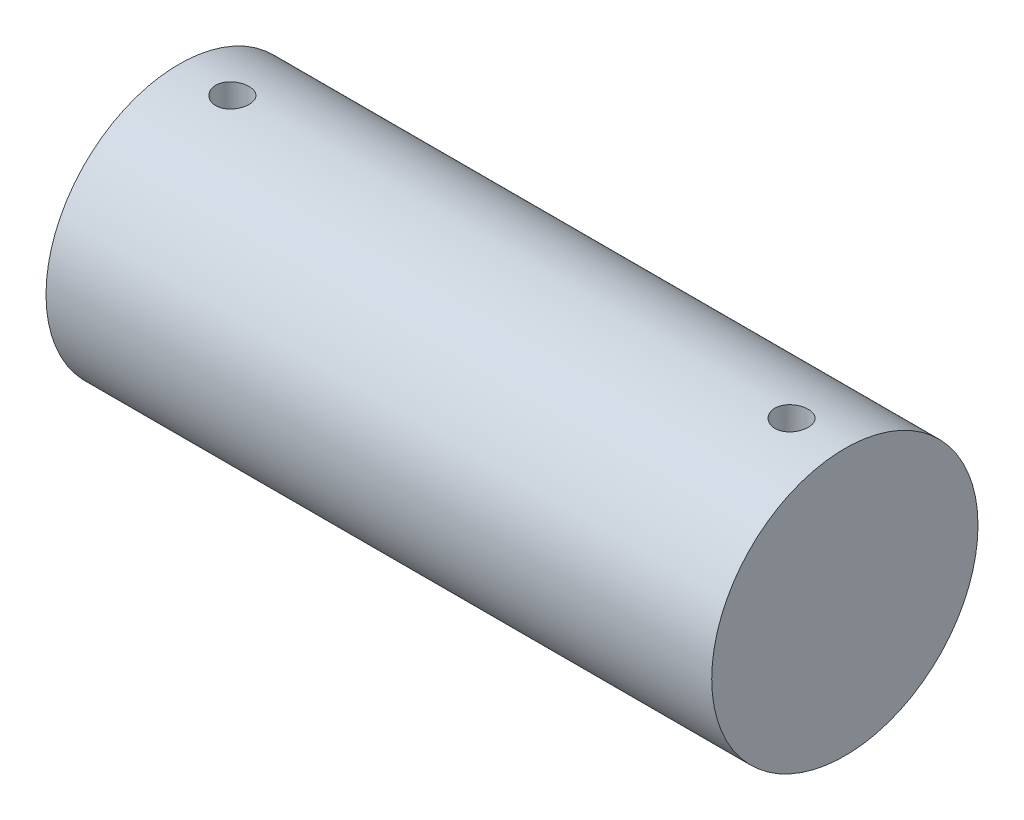
ISO-10303-21;
HEADER;
FILE_DESCRIPTION(('STEP AP214'),'2;1');
FILE_NAME('part.step','',(''),(''),'','','');
FILE_SCHEMA(('AUTOMOTIVE_DESIGN { 1 0 10303 214 1 1 1 1 }'));
ENDSEC;
DATA;
#1=APPLICATION_CONTEXT('core data for automotive mechanical design processes');
#2=APPLICATION_PROTOCOL_DEFINITION('international standard','automotive_design',2000,#1);
#3=PRODUCT_CONTEXT('',#1,'mechanical');
#4=PRODUCT('Part','Part','',(#3));
#5=PRODUCT_RELATED_PRODUCT_CATEGORY('part','',(#4));
#6=PRODUCT_DEFINITION_FORMATION('','',#4);
#7=PRODUCT_DEFINITION_CONTEXT('part definition',#1,'design');
#8=PRODUCT_DEFINITION('design','',#6,#7);
#9=PRODUCT_DEFINITION_SHAPE('','',#8);
#10=(LENGTH_UNIT() NAMED_UNIT(*) SI_UNIT(.MILLI.,.METRE.));
#11=(NAMED_UNIT(*) PLANE_ANGLE_UNIT() SI_UNIT($,.RADIAN.));
#12=(NAMED_UNIT(*) SI_UNIT($,.STERADIAN.) SOLID_ANGLE_UNIT());
#13=UNCERTAINTY_MEASURE_WITH_UNIT(LENGTH_MEASURE(1.E-05),#10,'distance_accuracy_value','');
#14=(GEOMETRIC_REPRESENTATION_CONTEXT(3) GLOBAL_UNCERTAINTY_ASSIGNED_CONTEXT((#13)) GLOBAL_UNIT_ASSIGNED_CONTEXT((#10,
#11,#12)) REPRESENTATION_CONTEXT('',''));
#15=CARTESIAN_POINT('',(0.,0.,0.));
#16=DIRECTION('',(0.,0.,1.));
#17=DIRECTION('',(1.,0.,0.));
#18=AXIS2_PLACEMENT_3D('',#15,#16,#17);
#19=CARTESIAN_POINT('',(7.49999975746537,1.51517477467844E-08,6.06634770287263E-08));
#20=DIRECTION('',(-1.,0.,0.));
#21=DIRECTION('',(0.,0.,1.));
#22=AXIS2_PLACEMENT_3D('',#19,#20,#21);
#23=CYLINDRICAL_SURFACE('',#22,1.);
#24=CARTESIAN_POINT('',(7.49999975746537,1.51517477467844E-08,6.06634770287263E-08));
#25=DIRECTION('',(1.,0.,0.));
#26=DIRECTION('',(0.,0.,-1.));
#27=AXIS2_PLACEMENT_3D('',#24,#25,#26);
#28=CIRCLE('',#27,1.);
#29=CARTESIAN_POINT('',(7.49999975746537,1.51517477467844E-08,-0.999999939336523));
#30=VERTEX_POINT('',#29);
#31=EDGE_CURVE('E10',#30,#30,#28,.T.);
#32=ORIENTED_EDGE('',*,*,#31,.F.);
#33=EDGE_LOOP('',(#32));
#34=FACE_BOUND('',#33,.T.);
#35=CARTESIAN_POINT('',(2.49999975746537,1.51517477467844E-08,6.06634770287263E-08));
#36=DIRECTION('',(1.,0.,0.));
#37=DIRECTION('',(0.,0.,-1.));
#38=AXIS2_PLACEMENT_3D('',#35,#36,#37);
#39=CIRCLE('',#38,1.);
#40=CARTESIAN_POINT('',(2.49999975746537,1.51517477467844E-08,-0.999999939336523));
#41=VERTEX_POINT('',#40);
#42=EDGE_CURVE('E49',#41,#41,#39,.T.);
#43=ORIENTED_EDGE('',*,*,#42,.T.);
#44=EDGE_LOOP('',(#43));
#45=FACE_BOUND('',#44,.T.);
#46=CARTESIAN_POINT('',(7.09999975746537,-0.992156726497474,-0.124999939336523));
#47=CARTESIAN_POINT('',(7.10699157165496,-0.992156826933916,-0.12499964207822));
#48=CARTESIAN_POINT('',(7.11398775571061,-0.992231432407725,-0.124411334287587));
#49=CARTESIAN_POINT('',(7.1277854187356,-0.992521680338238,-0.12207376002259));
#50=CARTESIAN_POINT('',(7.13458668649022,-0.992737470169733,-0.120323280391087));
#51=CARTESIAN_POINT('',(7.14779275157117,-0.993285271735966,-0.115713773977821));
#52=CARTESIAN_POINT('',(7.1541978145713,-0.993617204575078,-0.112855499576434));
#53=CARTESIAN_POINT('',(7.16643618005653,-0.994359796608206,-0.106113149257999));
#54=CARTESIAN_POINT('',(7.17226958005252,-0.994770442340394,-0.102229248705262));
#55=CARTESIAN_POINT('',(7.18323286982148,-0.995626764470202,-0.0935226118497431));
#56=CARTESIAN_POINT('',(7.18835909758132,-0.996072605699274,-0.0886952800877367));
#57=CARTESIAN_POINT('',(7.19773089591233,-0.996947601286168,-0.0782487023700833));
#58=CARTESIAN_POINT('',(7.20197642267011,-0.997376754812944,-0.072629417039424));
#59=CARTESIAN_POINT('',(7.20947943644069,-0.998171707154664,-0.0607354308703211));
#60=CARTESIAN_POINT('',(7.21273360972035,-0.998537291771655,-0.054458624114578));
#61=CARTESIAN_POINT('',(7.21814031746242,-0.999162103325515,-0.0414422752393181));
#62=CARTESIAN_POINT('',(7.2202928928117,-0.999421334209736,-0.0347027503045677));
#63=CARTESIAN_POINT('',(7.22342436088209,-0.999803069201366,-0.0209897237240781));
#64=CARTESIAN_POINT('',(7.22440934139156,-0.999926282266222,-0.0140176323196913));
#65=CARTESIAN_POINT('',(7.2251965267172,-1.00002451971286,-6.09937084979584E-06));
#66=CARTESIAN_POINT('',(7.224998778063,-0.999999549924291,0.00703333951321602));
#67=CARTESIAN_POINT('',(7.2234309973275,-0.999804808733257,0.0209383241122047));
#68=CARTESIAN_POINT('',(7.2220675125413,-0.999635846076116,0.0278046209516998));
#69=CARTESIAN_POINT('',(7.21821719863387,-0.999173012819419,0.0412101688587459));
#70=CARTESIAN_POINT('',(7.21573034815703,-0.998879139845275,0.0477494137062874));
#71=CARTESIAN_POINT('',(7.20969693282618,-0.998198113752209,0.0603355014354091));
#72=CARTESIAN_POINT('',(7.20614753457886,-0.997810711769871,0.0663809720555031));
#73=CARTESIAN_POINT('',(7.19809183935457,-0.996985969380893,0.077792933278801));
#74=CARTESIAN_POINT('',(7.19358549849194,-0.996548626684384,0.083159392724345));
#75=CARTESIAN_POINT('',(7.18370716653545,-0.995669418610009,0.0930994622021242));
#76=CARTESIAN_POINT('',(7.17832946948804,-0.995227542750616,0.0976674026632766));
#77=CARTESIAN_POINT('',(7.16688067962625,-0.994392020818542,0.105836703194732));
#78=CARTESIAN_POINT('',(7.16080958463847,-0.993998374897042,0.109438060235232));
#79=CARTESIAN_POINT('',(7.14814128268725,-0.993303886154611,0.115572289342614));
#80=CARTESIAN_POINT('',(7.14154385346771,-0.993003082802318,0.118104707156593));
#81=CARTESIAN_POINT('',(7.12801278478903,-0.99252910609623,0.122024143386881));
#82=CARTESIAN_POINT('',(7.12107916154993,-0.992355926591604,0.123411217003458));
#83=CARTESIAN_POINT('',(7.10712259836538,-0.992157929240277,0.124993082258907));
#84=CARTESIAN_POINT('',(7.10010057631093,-0.99213211856944,0.125195852763391));
#85=CARTESIAN_POINT('',(7.0861226609821,-0.992229155408076,0.124424408325005));
#86=CARTESIAN_POINT('',(7.07916676630141,-0.992351999748978,0.123450218468967));
#87=CARTESIAN_POINT('',(7.06554246928648,-0.992731599090245,0.120359224953363));
#88=CARTESIAN_POINT('',(7.05887317670585,-0.992987901195582,0.11824628485078));
#89=CARTESIAN_POINT('',(7.04598354972271,-0.993605169833656,0.112941746619283));
#90=CARTESIAN_POINT('',(7.03976323110333,-0.993966140043634,0.109750110592538));
#91=CARTESIAN_POINT('',(7.02791202527472,-0.994754450524869,0.102359161771223));
#92=CARTESIAN_POINT('',(7.02228442419965,-0.995182131216793,0.0981546166423325));
#93=CARTESIAN_POINT('',(7.01181192976862,-0.996054604623763,0.0888645977819252));
#94=CARTESIAN_POINT('',(7.00696706687197,-0.996499398003896,0.0837790897847514));
#95=CARTESIAN_POINT('',(6.99816954809865,-0.997359029191732,0.0728366494414032));
#96=CARTESIAN_POINT('',(6.99422213512562,-0.997773681804513,0.0669754852693287));
#97=CARTESIAN_POINT('',(6.98736784658368,-0.998523541364057,0.0546686897475665));
#98=CARTESIAN_POINT('',(6.98446095004132,-0.998858749912109,0.0482230701818932));
#99=CARTESIAN_POINT('',(6.97977886811997,-0.999411130174846,0.0349477536204497));
#100=CARTESIAN_POINT('',(6.97800065266379,-0.999628617692105,0.0281191389890659));
#101=CARTESIAN_POINT('',(6.97561655300403,-0.999922362187034,0.0142573635273749));
#102=CARTESIAN_POINT('',(6.97501061593541,-0.999998625533341,0.00722421193538219));
#103=CARTESIAN_POINT('',(6.97498926135076,-1.00000129885508,-0.00679579850371256));
#104=CARTESIAN_POINT('',(6.97556575943697,-0.999928726432172,-0.0137826462222602));
#105=CARTESIAN_POINT('',(6.97787578813691,-0.999643905427222,-0.0275593264091541));
#106=CARTESIAN_POINT('',(6.97960931794596,-0.999431656942325,-0.0343491590145156));
#107=CARTESIAN_POINT('',(6.98418166318286,-0.998891227454269,-0.0475380114858888));
#108=CARTESIAN_POINT('',(6.98702009143403,-0.998563087065487,-0.0539371673445017));
#109=CARTESIAN_POINT('',(6.99372082319575,-0.997827208651393,-0.0661696061937243));
#110=CARTESIAN_POINT('',(6.99758313887846,-0.997419469679812,-0.0720028824559245));
#111=CARTESIAN_POINT('',(7.00625191823219,-0.996566581811041,-0.0829792777346509));
#112=CARTESIAN_POINT('',(7.01106439714155,-0.996121205487712,-0.0881176287282381));
#113=CARTESIAN_POINT('',(7.02148440466681,-0.995245064355023,-0.0975169952774904));
#114=CARTESIAN_POINT('',(7.02709212133992,-0.994814303031751,-0.101777802726197));
#115=CARTESIAN_POINT('',(7.03896825360024,-0.994014390545596,-0.109315201462325));
#116=CARTESIAN_POINT('',(7.04523913696213,-0.993645483724393,-0.11258792849486));
#117=CARTESIAN_POINT('',(7.05824259449511,-0.993013913908063,-0.118029203753691));
#118=CARTESIAN_POINT('',(7.06497465743054,-0.992751135425191,-0.120198952897938));
#119=CARTESIAN_POINT('',(7.07645125681755,-0.992425378258173,-0.122853234148422));
#120=CARTESIAN_POINT('',(7.08112340504225,-0.992325135609207,-0.123657090887052));
#121=CARTESIAN_POINT('',(7.09052961996372,-0.992190775963208,-0.124730542131798));
#122=CARTESIAN_POINT('',(7.09526368619042,-0.992156658464466,-0.125000140691489));
#123=CARTESIAN_POINT('',(7.09999975746537,-0.992156726497474,-0.124999939336523));
#124=B_SPLINE_CURVE_WITH_KNOTS('',3,(#46,#47,#48,#49,#50,#51,#52,#53,#54,#55,#56,#57,#58,#59,
#60,#61,#62,#63,#64,#65,#66,#67,#68,#69,#70,#71,#72,#73,#74,#75,#76,#77,#78,#79,#80,#81,#82,#83,
#84,#85,#86,#87,#88,#89,#90,#91,#92,#93,#94,#95,#96,#97,#98,#99,#100,#101,#102,#103,#104,#105,
#106,#107,#108,#109,#110,#111,#112,#113,#114,#115,#116,#117,#118,#119,#120,#121,#122,#123),
.UNSPECIFIED.,.T.,.F.,(4,2,2,2,2,2,2,2,2,2,2,2,2,2,2,2,2,2,2,2,2,2,2,2,2,2,2,2,2,2,2,2,2,2,2,2,
2,2,4),(0.,0.0209581408739618,0.0419381938076193,0.0629040226290611,0.0838662689753075,
0.104933288774534,0.12600135637129,0.147139093072871,0.168276045169916,0.189302298470729,
0.210327724585054,0.231235832466519,0.252144337835895,0.273109102206402,0.294074828234553,
0.315183848688885,0.336292935309712,0.357410983369504,0.378528013578094,0.39950260890294,
0.420476757163557,0.441380188146366,0.462284353605925,0.483298909772054,0.504314283497405,
0.525449442946171,0.546584176354438,0.56766192839247,0.588738729886406,0.609671908144127,
0.630605071843394,0.651530906772044,0.672456990482123,0.693520064445417,0.714588127719914,
0.735737548852416,0.756863892991007,0.771060494816473,0.785256988927736),.UNSPECIFIED.);
#125=CARTESIAN_POINT('',(7.09999975746537,-0.992156726497474,-0.124999939336523));
#126=VERTEX_POINT('',#125);
#127=EDGE_CURVE('E57',#126,#126,#124,.T.);
#128=ORIENTED_EDGE('',*,*,#127,.F.);
#129=EDGE_LOOP('',(#128));
#130=FACE_BOUND('',#129,.T.);
#131=CARTESIAN_POINT('',(7.09999975746537,0.992156756800969,-0.124999939336523));
#132=CARTESIAN_POINT('',(7.09300794327578,0.992156857237412,-0.12499964207822));
#133=CARTESIAN_POINT('',(7.08601175922013,0.99223146271122,-0.124411334287587));
#134=CARTESIAN_POINT('',(7.07221409619514,0.992521710641733,-0.12207376002259));
#135=CARTESIAN_POINT('',(7.06541282844052,0.992737500473228,-0.120323280391087));
#136=CARTESIAN_POINT('',(7.05220676335957,0.993285302039461,-0.115713773977821));
#137=CARTESIAN_POINT('',(7.04580170035944,0.993617234878573,-0.112855499576435));
#138=CARTESIAN_POINT('',(7.03356333487422,0.994359826911701,-0.106113149257999));
#139=CARTESIAN_POINT('',(7.02772993487822,0.994770472643889,-0.102229248705262));
#140=CARTESIAN_POINT('',(7.01676664510927,0.995626794773698,-0.0935226118497431));
#141=CARTESIAN_POINT('',(7.01164041734943,0.996072636002769,-0.0886952800877375));
#142=CARTESIAN_POINT('',(7.00226861901842,0.996947631589664,-0.0782487023700841));
#143=CARTESIAN_POINT('',(6.99802309226064,0.997376785116439,-0.072629417039424));
#144=CARTESIAN_POINT('',(6.99052007849005,0.998171737458159,-0.0607354308703208));
#145=CARTESIAN_POINT('',(6.98726590521039,0.99853732207515,-0.0544586241145781));
#146=CARTESIAN_POINT('',(6.98185919746832,0.999162133629011,-0.0414422752393183));
#147=CARTESIAN_POINT('',(6.97970662211904,0.999421364513231,-0.0347027503045677));
#148=CARTESIAN_POINT('',(6.97657515404865,0.999803099504862,-0.0209897237240781));
#149=CARTESIAN_POINT('',(6.97559017353918,0.999926312569718,-0.0140176323196914));
#150=CARTESIAN_POINT('',(6.97480298821354,1.00002455001636,-6.09937084995E-06));
#151=CARTESIAN_POINT('',(6.97500073686775,0.999999580227786,0.00703333951321588));
#152=CARTESIAN_POINT('',(6.97656851760324,0.999804839036752,0.0209383241122046));
#153=CARTESIAN_POINT('',(6.97793200238944,0.999635876379611,0.0278046209516999));
#154=CARTESIAN_POINT('',(6.98178231629687,0.999173043122914,0.041210168858746));
#155=CARTESIAN_POINT('',(6.98426916677371,0.998879170148771,0.0477494137062874));
#156=CARTESIAN_POINT('',(6.99030258210456,0.998198144055704,0.0603355014354091));
#157=CARTESIAN_POINT('',(6.99385198035188,0.997810742073367,0.0663809720555032));
#158=CARTESIAN_POINT('',(7.00190767557617,0.996985999684389,0.077792933278801));
#159=CARTESIAN_POINT('',(7.0064140164388,0.996548656987879,0.083159392724345));
#160=CARTESIAN_POINT('',(7.01629234839529,0.995669448913504,0.0930994622021245));
#161=CARTESIAN_POINT('',(7.02167004544271,0.995227573054111,0.0976674026632771));
#162=CARTESIAN_POINT('',(7.03311883530449,0.994392051122037,0.105836703194732));
#163=CARTESIAN_POINT('',(7.03918993029227,0.993998405200538,0.109438060235232));
#164=CARTESIAN_POINT('',(7.05185823224349,0.993303916458107,0.115572289342613));
#165=CARTESIAN_POINT('',(7.05845566146303,0.993003113105813,0.118104707156593));
#166=CARTESIAN_POINT('',(7.07198673014171,0.992529136399726,0.122024143386881));
#167=CARTESIAN_POINT('',(7.07892035338081,0.992355956895099,0.123411217003458));
#168=CARTESIAN_POINT('',(7.09287691656536,0.992157959543773,0.124993082258907));
#169=CARTESIAN_POINT('',(7.09989893861981,0.992132148872935,0.125195852763391));
#170=CARTESIAN_POINT('',(7.11387685394864,0.992229185711571,0.124424408325005));
#171=CARTESIAN_POINT('',(7.12083274862934,0.992352030052473,0.123450218468967));
#172=CARTESIAN_POINT('',(7.13445704564426,0.992731629393741,0.120359224953363));
#173=CARTESIAN_POINT('',(7.14112633822489,0.992987931499078,0.11824628485078));
#174=CARTESIAN_POINT('',(7.15401596520803,0.993605200137151,0.112941746619283));
#175=CARTESIAN_POINT('',(7.16023628382742,0.993966170347129,0.109750110592538));
#176=CARTESIAN_POINT('',(7.17208748965602,0.994754480828365,0.102359161771223));
#177=CARTESIAN_POINT('',(7.17771509073109,0.995182161520288,0.098154616642332));
#178=CARTESIAN_POINT('',(7.18818758516212,0.996054634927259,0.0888645977819246));
#179=CARTESIAN_POINT('',(7.19303244805877,0.996499428307392,0.0837790897847513));
#180=CARTESIAN_POINT('',(7.20182996683209,0.997359059495227,0.0728366494414033));
#181=CARTESIAN_POINT('',(7.20577737980512,0.997773712108008,0.0669754852693287));
#182=CARTESIAN_POINT('',(7.21263166834706,0.998523571667552,0.0546686897475664));
#183=CARTESIAN_POINT('',(7.21553856488942,0.998858780215605,0.0482230701818931));
#184=CARTESIAN_POINT('',(7.22022064681077,0.999411160478341,0.0349477536204497));
#185=CARTESIAN_POINT('',(7.22199886226695,0.9996286479956,0.0281191389890658));
#186=CARTESIAN_POINT('',(7.22438296192671,0.99992239249053,0.0142573635273748));
#187=CARTESIAN_POINT('',(7.22498889899533,0.999998655836836,0.0072242119353821));
#188=CARTESIAN_POINT('',(7.22501025357998,1.00000132915858,-0.00679579850371239));
#189=CARTESIAN_POINT('',(7.22443375549377,0.999928756735667,-0.0137826462222598));
#190=CARTESIAN_POINT('',(7.22212372679383,0.999643935730717,-0.0275593264091538));
#191=CARTESIAN_POINT('',(7.22039019698478,0.99943168724582,-0.0343491590145157));
#192=CARTESIAN_POINT('',(7.21581785174789,0.998891257757764,-0.0475380114858887));
#193=CARTESIAN_POINT('',(7.21297942349671,0.998563117368983,-0.0539371673445011));
#194=CARTESIAN_POINT('',(7.20627869173499,0.997827238954888,-0.0661696061937237));
#195=CARTESIAN_POINT('',(7.20241637605229,0.997419499983307,-0.0720028824559243));
#196=CARTESIAN_POINT('',(7.19374759669855,0.996566612114537,-0.0829792777346506));
#197=CARTESIAN_POINT('',(7.18893511778919,0.996121235791208,-0.0881176287282375));
#198=CARTESIAN_POINT('',(7.17851511026393,0.995245094658518,-0.0975169952774899));
#199=CARTESIAN_POINT('',(7.17290739359083,0.994814333335246,-0.101777802726197));
#200=CARTESIAN_POINT('',(7.1610312613305,0.994014420849091,-0.109315201462325));
#201=CARTESIAN_POINT('',(7.15476037796862,0.993645514027888,-0.11258792849486));
#202=CARTESIAN_POINT('',(7.14175692043563,0.993013944211559,-0.11802920375369));
#203=CARTESIAN_POINT('',(7.1350248575002,0.992751165728686,-0.120198952897938));
#204=CARTESIAN_POINT('',(7.12354825811319,0.992425408561669,-0.122853234148422));
#205=CARTESIAN_POINT('',(7.11887610988849,0.992325165912702,-0.123657090887052));
#206=CARTESIAN_POINT('',(7.10946989496702,0.992190806266704,-0.124730542131798));
#207=CARTESIAN_POINT('',(7.10473582874032,0.992156688767961,-0.125000140691489));
#208=CARTESIAN_POINT('',(7.09999975746537,0.992156756800969,-0.124999939336523));
#209=B_SPLINE_CURVE_WITH_KNOTS('',3,(#131,#132,#133,#134,#135,#136,#137,#138,#139,#140,#141,
#142,#143,#144,#145,#146,#147,#148,#149,#150,#151,#152,#153,#154,#155,#156,#157,#158,#159,#160,
#161,#162,#163,#164,#165,#166,#167,#168,#169,#170,#171,#172,#173,#174,#175,#176,#177,#178,#179,
#180,#181,#182,#183,#184,#185,#186,#187,#188,#189,#190,#191,#192,#193,#194,#195,#196,#197,#198,
#199,#200,#201,#202,#203,#204,#205,#206,#207,#208),.UNSPECIFIED.,.T.,.F.,(4,2,2,2,2,2,2,2,2,2,2,
2,2,2,2,2,2,2,2,2,2,2,2,2,2,2,2,2,2,2,2,2,2,2,2,2,2,2,4),(0.,0.0209581408739618,
0.0419381938076193,0.0629040226290601,0.083866268975306,0.104933288774533,0.126001356371289,
0.14713909307287,0.168276045169915,0.189302298470728,0.210327724585054,0.231235832466519,
0.252144337835894,0.273109102206402,0.294074828234552,0.315183848688885,0.336292935309712,
0.357410983369503,0.378528013578093,0.399502608902939,0.420476757163556,0.441380188146366,
0.462284353605926,0.483298909772054,0.504314283497404,0.52544944294617,0.546584176354438,
0.567661928392469,0.588738729886405,0.609671908144127,0.630605071843393,0.651530906772043,
0.672456990482123,0.693520064445416,0.714588127719913,0.735737548852416,0.756863892991007,
0.771060494816473,0.785256988927736),.UNSPECIFIED.);
#210=CARTESIAN_POINT('',(7.09999975746537,0.992156756800969,-0.124999939336523));
#211=VERTEX_POINT('',#210);
#212=EDGE_CURVE('E65',#211,#211,#209,.T.);
#213=ORIENTED_EDGE('',*,*,#212,.F.);
#214=EDGE_LOOP('',(#213));
#215=FACE_BOUND('',#214,.T.);
#216=CARTESIAN_POINT('',(2.89999975746537,-0.992156726497474,-0.124999939336523));
#217=CARTESIAN_POINT('',(2.90699157165496,-0.992156826933916,-0.12499964207822));
#218=CARTESIAN_POINT('',(2.91398775571061,-0.992231432407724,-0.124411334287587));
#219=CARTESIAN_POINT('',(2.9277854187356,-0.992521680338238,-0.12207376002259));
#220=CARTESIAN_POINT('',(2.93458668649022,-0.992737470169733,-0.120323280391088));
#221=CARTESIAN_POINT('',(2.94779275157117,-0.993285271735966,-0.115713773977821));
#222=CARTESIAN_POINT('',(2.9541978145713,-0.993617204575077,-0.112855499576435));
#223=CARTESIAN_POINT('',(2.96643618005653,-0.994359796608206,-0.106113149257999));
#224=CARTESIAN_POINT('',(2.97226958005252,-0.994770442340394,-0.102229248705262));
#225=CARTESIAN_POINT('',(2.98323286982148,-0.995626764470202,-0.0935226118497438));
#226=CARTESIAN_POINT('',(2.98835909758132,-0.996072605699273,-0.0886952800877377));
#227=CARTESIAN_POINT('',(2.99773089591232,-0.996947601286168,-0.0782487023700842));
#228=CARTESIAN_POINT('',(3.00197642267011,-0.997376754812944,-0.0726294170394245));
#229=CARTESIAN_POINT('',(3.00947943644069,-0.998171707154664,-0.0607354308703214));
#230=CARTESIAN_POINT('',(3.01273360972035,-0.998537291771655,-0.0544586241145785));
#231=CARTESIAN_POINT('',(3.01814031746242,-0.999162103325515,-0.0414422752393186));
#232=CARTESIAN_POINT('',(3.0202928928117,-0.999421334209736,-0.0347027503045681));
#233=CARTESIAN_POINT('',(3.02342436088209,-0.999803069201366,-0.0209897237240785));
#234=CARTESIAN_POINT('',(3.02440934139157,-0.999926282266222,-0.0140176323196917));
#235=CARTESIAN_POINT('',(3.0251965267172,-1.00002451971286,-6.09937085016853E-06));
#236=CARTESIAN_POINT('',(3.024998778063,-0.999999549924291,0.0070333395132157));
#237=CARTESIAN_POINT('',(3.0234309973275,-0.999804808733257,0.0209383241122046));
#238=CARTESIAN_POINT('',(3.0220675125413,-0.999635846076116,0.0278046209516999));
#239=CARTESIAN_POINT('',(3.01821719863387,-0.999173012819419,0.041210168858746));
#240=CARTESIAN_POINT('',(3.01573034815703,-0.998879139845275,0.0477494137062874));
#241=CARTESIAN_POINT('',(3.00969693282618,-0.998198113752209,0.0603355014354091));
#242=CARTESIAN_POINT('',(3.00614753457886,-0.997810711769871,0.0663809720555032));
#243=CARTESIAN_POINT('',(2.99809183935457,-0.996985969380893,0.077792933278801));
#244=CARTESIAN_POINT('',(2.99358549849194,-0.996548626684384,0.083159392724345));
#245=CARTESIAN_POINT('',(2.98370716653545,-0.995669418610009,0.0930994622021243));
#246=CARTESIAN_POINT('',(2.97832946948804,-0.995227542750616,0.0976674026632769));
#247=CARTESIAN_POINT('',(2.96688067962625,-0.994392020818542,0.105836703194732));
#248=CARTESIAN_POINT('',(2.96080958463847,-0.993998374897042,0.109438060235232));
#249=CARTESIAN_POINT('',(2.94814128268725,-0.993303886154611,0.115572289342614));
#250=CARTESIAN_POINT('',(2.94154385346771,-0.993003082802317,0.118104707156593));
#251=CARTESIAN_POINT('',(2.92801278478903,-0.99252910609623,0.122024143386881));
#252=CARTESIAN_POINT('',(2.92107916154993,-0.992355926591603,0.123411217003458));
#253=CARTESIAN_POINT('',(2.90712259836538,-0.992157929240277,0.124993082258907));
#254=CARTESIAN_POINT('',(2.90010057631093,-0.99213211856944,0.125195852763391));
#255=CARTESIAN_POINT('',(2.8861226609821,-0.992229155408076,0.124424408325005));
#256=CARTESIAN_POINT('',(2.87916676630141,-0.992351999748978,0.123450218468967));
#257=CARTESIAN_POINT('',(2.86554246928648,-0.992731599090245,0.120359224953363));
#258=CARTESIAN_POINT('',(2.85887317670585,-0.992987901195582,0.11824628485078));
#259=CARTESIAN_POINT('',(2.84598354972271,-0.993605169833656,0.112941746619283));
#260=CARTESIAN_POINT('',(2.83976323110333,-0.993966140043634,0.109750110592538));
#261=CARTESIAN_POINT('',(2.82791202527472,-0.994754450524869,0.102359161771223));
#262=CARTESIAN_POINT('',(2.82228442419965,-0.995182131216793,0.0981546166423323));
#263=CARTESIAN_POINT('',(2.81181192976862,-0.996054604623763,0.0888645977819248));
#264=CARTESIAN_POINT('',(2.80696706687197,-0.996499398003896,0.0837790897847512));
#265=CARTESIAN_POINT('',(2.79816954809865,-0.997359029191732,0.072836649441403));
#266=CARTESIAN_POINT('',(2.79422213512562,-0.997773681804513,0.0669754852693285));
#267=CARTESIAN_POINT('',(2.78736784658368,-0.998523541364057,0.0546686897475663));
#268=CARTESIAN_POINT('',(2.78446095004132,-0.99885874991211,0.048223070181893));
#269=CARTESIAN_POINT('',(2.77977886811997,-0.999411130174846,0.0349477536204497));
#270=CARTESIAN_POINT('',(2.77800065266379,-0.999628617692105,0.028119138989066));
#271=CARTESIAN_POINT('',(2.77561655300403,-0.999922362187034,0.0142573635273751));
#272=CARTESIAN_POINT('',(2.77501061593541,-0.999998625533341,0.00722421193538235));
#273=CARTESIAN_POINT('',(2.77498926135076,-1.00000129885508,-0.00679579850371228));
#274=CARTESIAN_POINT('',(2.77556575943697,-0.999928726432172,-0.0137826462222598));
#275=CARTESIAN_POINT('',(2.77787578813691,-0.999643905427222,-0.0275593264091538));
#276=CARTESIAN_POINT('',(2.77960931794596,-0.999431656942325,-0.0343491590145156));
#277=CARTESIAN_POINT('',(2.78418166318286,-0.998891227454269,-0.0475380114858888));
#278=CARTESIAN_POINT('',(2.78702009143403,-0.998563087065487,-0.0539371673445015));
#279=CARTESIAN_POINT('',(2.79372082319575,-0.997827208651393,-0.0661696061937242));
#280=CARTESIAN_POINT('',(2.79758313887846,-0.997419469679812,-0.0720028824559245));
#281=CARTESIAN_POINT('',(2.80625191823219,-0.996566581811041,-0.0829792777346509));
#282=CARTESIAN_POINT('',(2.81106439714155,-0.996121205487712,-0.0881176287282381));
#283=CARTESIAN_POINT('',(2.82148440466681,-0.995245064355023,-0.0975169952774904));
#284=CARTESIAN_POINT('',(2.82709212133992,-0.994814303031751,-0.101777802726198));
#285=CARTESIAN_POINT('',(2.83896825360024,-0.994014390545596,-0.109315201462325));
#286=CARTESIAN_POINT('',(2.84523913696213,-0.993645483724393,-0.11258792849486));
#287=CARTESIAN_POINT('',(2.85824259449511,-0.993013913908063,-0.118029203753691));
#288=CARTESIAN_POINT('',(2.86497465743054,-0.992751135425191,-0.120198952897939));
#289=CARTESIAN_POINT('',(2.87645125681755,-0.992425378258173,-0.122853234148422));
#290=CARTESIAN_POINT('',(2.88112340504225,-0.992325135609207,-0.123657090887052));
#291=CARTESIAN_POINT('',(2.89052961996372,-0.992190775963208,-0.124730542131799));
#292=CARTESIAN_POINT('',(2.89526368619042,-0.992156658464466,-0.125000140691489));
#293=CARTESIAN_POINT('',(2.89999975746537,-0.992156726497474,-0.124999939336523));
#294=B_SPLINE_CURVE_WITH_KNOTS('',3,(#216,#217,#218,#219,#220,#221,#222,#223,#224,#225,#226,
#227,#228,#229,#230,#231,#232,#233,#234,#235,#236,#237,#238,#239,#240,#241,#242,#243,#244,#245,
#246,#247,#248,#249,#250,#251,#252,#253,#254,#255,#256,#257,#258,#259,#260,#261,#262,#263,#264,
#265,#266,#267,#268,#269,#270,#271,#272,#273,#274,#275,#276,#277,#278,#279,#280,#281,#282,#283,
#284,#285,#286,#287,#288,#289,#290,#291,#292,#293),.UNSPECIFIED.,.T.,.F.,(4,2,2,2,2,2,2,2,2,2,2,
2,2,2,2,2,2,2,2,2,2,2,2,2,2,2,2,2,2,2,2,2,2,2,2,2,2,2,4),(0.,0.0209581408739618,
0.0419381938076193,0.0629040226290601,0.0838662689753065,0.104933288774533,0.12600135637129,
0.147139093072871,0.168276045169915,0.189302298470729,0.210327724585054,0.23123583246652,
0.252144337835895,0.273109102206402,0.294074828234553,0.315183848688885,0.336292935309713,
0.357410983369504,0.378528013578094,0.399502608902941,0.420476757163558,0.441380188146367,
0.462284353605927,0.483298909772055,0.504314283497406,0.525449442946171,0.546584176354439,
0.56766192839247,0.588738729886406,0.609671908144128,0.630605071843394,0.651530906772045,
0.672456990482124,0.693520064445418,0.714588127719915,0.735737548852418,0.756863892991009,
0.771060494816475,0.785256988927737),.UNSPECIFIED.);
#295=CARTESIAN_POINT('',(2.89999975746537,-0.992156726497474,-0.124999939336523));
#296=VERTEX_POINT('',#295);
#297=EDGE_CURVE('E99',#296,#296,#294,.T.);
#298=ORIENTED_EDGE('',*,*,#297,.F.);
#299=EDGE_LOOP('',(#298));
#300=FACE_BOUND('',#299,.T.);
#301=CARTESIAN_POINT('',(2.89999975746537,0.992156756800969,-0.124999939336523));
#302=CARTESIAN_POINT('',(2.89300794327578,0.992156857237412,-0.12499964207822));
#303=CARTESIAN_POINT('',(2.88601175922013,0.99223146271122,-0.124411334287587));
#304=CARTESIAN_POINT('',(2.87221409619514,0.992521710641733,-0.12207376002259));
#305=CARTESIAN_POINT('',(2.86541282844052,0.992737500473228,-0.120323280391088));
#306=CARTESIAN_POINT('',(2.85220676335957,0.993285302039461,-0.115713773977821));
#307=CARTESIAN_POINT('',(2.84580170035944,0.993617234878573,-0.112855499576435));
#308=CARTESIAN_POINT('',(2.83356333487422,0.994359826911701,-0.106113149257999));
#309=CARTESIAN_POINT('',(2.82772993487822,0.994770472643889,-0.102229248705262));
#310=CARTESIAN_POINT('',(2.81676664510926,0.995626794773698,-0.0935226118497438));
#311=CARTESIAN_POINT('',(2.81164041734943,0.996072636002769,-0.0886952800877377));
#312=CARTESIAN_POINT('',(2.80226861901842,0.996947631589663,-0.0782487023700842));
#313=CARTESIAN_POINT('',(2.79802309226064,0.997376785116439,-0.0726294170394245));
#314=CARTESIAN_POINT('',(2.79052007849005,0.998171737458159,-0.0607354308703215));
#315=CARTESIAN_POINT('',(2.78726590521039,0.99853732207515,-0.0544586241145787));
#316=CARTESIAN_POINT('',(2.78185919746832,0.999162133629011,-0.0414422752393188));
#317=CARTESIAN_POINT('',(2.77970662211904,0.999421364513231,-0.0347027503045682));
#318=CARTESIAN_POINT('',(2.77657515404865,0.999803099504862,-0.0209897237240785));
#319=CARTESIAN_POINT('',(2.77559017353918,0.999926312569718,-0.0140176323196918));
#320=CARTESIAN_POINT('',(2.77480298821354,1.00002455001636,-6.09937085021851E-06));
#321=CARTESIAN_POINT('',(2.77500073686774,0.999999580227786,0.00703333951321564));
#322=CARTESIAN_POINT('',(2.77656851760324,0.999804839036752,0.0209383241122045));
#323=CARTESIAN_POINT('',(2.77793200238944,0.999635876379611,0.0278046209516998));
#324=CARTESIAN_POINT('',(2.78178231629687,0.999173043122914,0.0412101688587459));
#325=CARTESIAN_POINT('',(2.78426916677371,0.998879170148771,0.0477494137062873));
#326=CARTESIAN_POINT('',(2.79030258210456,0.998198144055704,0.060335501435409));
#327=CARTESIAN_POINT('',(2.79385198035188,0.997810742073367,0.0663809720555031));
#328=CARTESIAN_POINT('',(2.80190767557617,0.996985999684389,0.077792933278801));
#329=CARTESIAN_POINT('',(2.8064140164388,0.996548656987879,0.0831593927243449));
#330=CARTESIAN_POINT('',(2.81629234839529,0.995669448913504,0.0930994622021243));
#331=CARTESIAN_POINT('',(2.8216700454427,0.995227573054111,0.0976674026632769));
#332=CARTESIAN_POINT('',(2.83311883530449,0.994392051122037,0.105836703194732));
#333=CARTESIAN_POINT('',(2.83918993029227,0.993998405200538,0.109438060235232));
#334=CARTESIAN_POINT('',(2.85185823224349,0.993303916458106,0.115572289342614));
#335=CARTESIAN_POINT('',(2.85845566146303,0.993003113105813,0.118104707156593));
#336=CARTESIAN_POINT('',(2.87198673014171,0.992529136399726,0.122024143386881));
#337=CARTESIAN_POINT('',(2.87892035338081,0.992355956895099,0.123411217003458));
#338=CARTESIAN_POINT('',(2.89287691656536,0.992157959543773,0.124993082258907));
#339=CARTESIAN_POINT('',(2.89989893861981,0.992132148872935,0.125195852763391));
#340=CARTESIAN_POINT('',(2.91387685394864,0.992229185711571,0.124424408325005));
#341=CARTESIAN_POINT('',(2.92083274862934,0.992352030052473,0.123450218468967));
#342=CARTESIAN_POINT('',(2.93445704564426,0.992731629393741,0.120359224953363));
#343=CARTESIAN_POINT('',(2.94112633822489,0.992987931499078,0.11824628485078));
#344=CARTESIAN_POINT('',(2.95401596520803,0.993605200137151,0.112941746619283));
#345=CARTESIAN_POINT('',(2.96023628382741,0.993966170347129,0.109750110592538));
#346=CARTESIAN_POINT('',(2.97208748965602,0.994754480828365,0.102359161771223));
#347=CARTESIAN_POINT('',(2.97771509073109,0.995182161520288,0.0981546166423322));
#348=CARTESIAN_POINT('',(2.98818758516212,0.996054634927259,0.0888645977819247));
#349=CARTESIAN_POINT('',(2.99303244805877,0.996499428307392,0.0837790897847511));
#350=CARTESIAN_POINT('',(3.00182996683209,0.997359059495227,0.072836649441403));
#351=CARTESIAN_POINT('',(3.00577737980512,0.997773712108008,0.0669754852693285));
#352=CARTESIAN_POINT('',(3.01263166834706,0.998523571667552,0.0546686897475664));
#353=CARTESIAN_POINT('',(3.01553856488942,0.998858780215605,0.0482230701818931));
#354=CARTESIAN_POINT('',(3.02022064681077,0.999411160478341,0.0349477536204497));
#355=CARTESIAN_POINT('',(3.02199886226695,0.9996286479956,0.0281191389890659));
#356=CARTESIAN_POINT('',(3.02438296192671,0.999922392490529,0.014257363527375));
#357=CARTESIAN_POINT('',(3.02498889899533,0.999998655836836,0.00722421193538232));
#358=CARTESIAN_POINT('',(3.02501025357998,1.00000132915858,-0.00679579850371224));
#359=CARTESIAN_POINT('',(3.02443375549377,0.999928756735667,-0.0137826462222598));
#360=CARTESIAN_POINT('',(3.02212372679383,0.999643935730717,-0.0275593264091537));
#361=CARTESIAN_POINT('',(3.02039019698478,0.99943168724582,-0.0343491590145155));
#362=CARTESIAN_POINT('',(3.01581785174789,0.998891257757764,-0.0475380114858888));
#363=CARTESIAN_POINT('',(3.01297942349671,0.998563117368983,-0.0539371673445015));
#364=CARTESIAN_POINT('',(3.00627869173499,0.997827238954888,-0.0661696061937241));
#365=CARTESIAN_POINT('',(3.00241637605229,0.997419499983307,-0.0720028824559245));
#366=CARTESIAN_POINT('',(2.99374759669855,0.996566612114537,-0.0829792777346509));
#367=CARTESIAN_POINT('',(2.98893511778919,0.996121235791208,-0.0881176287282381));
#368=CARTESIAN_POINT('',(2.97851511026393,0.995245094658518,-0.0975169952774903));
#369=CARTESIAN_POINT('',(2.97290739359083,0.994814333335246,-0.101777802726197));
#370=CARTESIAN_POINT('',(2.9610312613305,0.994014420849091,-0.109315201462325));
#371=CARTESIAN_POINT('',(2.95476037796862,0.993645514027889,-0.11258792849486));
#372=CARTESIAN_POINT('',(2.94175692043563,0.993013944211559,-0.118029203753691));
#373=CARTESIAN_POINT('',(2.9350248575002,0.992751165728686,-0.120198952897939));
#374=CARTESIAN_POINT('',(2.92354825811319,0.992425408561669,-0.122853234148422));
#375=CARTESIAN_POINT('',(2.91887610988849,0.992325165912702,-0.123657090887052));
#376=CARTESIAN_POINT('',(2.90946989496702,0.992190806266704,-0.124730542131798));
#377=CARTESIAN_POINT('',(2.90473582874032,0.992156688767961,-0.125000140691489));
#378=CARTESIAN_POINT('',(2.89999975746537,0.992156756800969,-0.124999939336523));
#379=B_SPLINE_CURVE_WITH_KNOTS('',3,(#301,#302,#303,#304,#305,#306,#307,#308,#309,#310,#311,
#312,#313,#314,#315,#316,#317,#318,#319,#320,#321,#322,#323,#324,#325,#326,#327,#328,#329,#330,
#331,#332,#333,#334,#335,#336,#337,#338,#339,#340,#341,#342,#343,#344,#345,#346,#347,#348,#349,
#350,#351,#352,#353,#354,#355,#356,#357,#358,#359,#360,#361,#362,#363,#364,#365,#366,#367,#368,
#369,#370,#371,#372,#373,#374,#375,#376,#377,#378),.UNSPECIFIED.,.T.,.F.,(4,2,2,2,2,2,2,2,2,2,2,
2,2,2,2,2,2,2,2,2,2,2,2,2,2,2,2,2,2,2,2,2,2,2,2,2,2,2,4),(0.,0.0209581408739622,
0.0419381938076193,0.0629040226290601,0.0838662689753065,0.104933288774533,0.12600135637129,
0.14713909307287,0.168276045169915,0.189302298470729,0.210327724585054,0.231235832466519,
0.252144337835895,0.273109102206402,0.294074828234553,0.315183848688885,0.336292935309713,
0.357410983369504,0.378528013578094,0.399502608902941,0.420476757163558,0.441380188146367,
0.462284353605927,0.483298909772056,0.504314283497406,0.525449442946171,0.546584176354439,
0.56766192839247,0.588738729886406,0.609671908144128,0.630605071843394,0.651530906772045,
0.672456990482124,0.693520064445418,0.714588127719915,0.735737548852417,0.756863892991008,
0.771060494816475,0.785256988927737),.UNSPECIFIED.);
#380=CARTESIAN_POINT('',(2.89999975746537,0.992156756800969,-0.124999939336523));
#381=VERTEX_POINT('',#380);
#382=EDGE_CURVE('E40',#381,#381,#379,.T.);
#383=ORIENTED_EDGE('',*,*,#382,.F.);
#384=EDGE_LOOP('',(#383));
#385=FACE_BOUND('',#384,.T.);
#386=ADVANCED_FACE('F36',(#34,#45,#130,#215,#300,#385),#23,.T.);
#387=CARTESIAN_POINT('',(7.49999975746537,1.51517477467844E-08,6.06634770287263E-08));
#388=DIRECTION('',(1.,0.,0.));
#389=DIRECTION('',(0.,0.,-1.));
#390=AXIS2_PLACEMENT_3D('',#387,#388,#389);
#391=PLANE('',#390);
#392=ORIENTED_EDGE('',*,*,#31,.T.);
#393=EDGE_LOOP('',(#392));
#394=FACE_BOUND('',#393,.T.);
#395=ADVANCED_FACE('F77',(#394),#391,.T.);
#396=CARTESIAN_POINT('',(2.49999975746537,1.51517477467844E-08,6.06634770287263E-08));
#397=DIRECTION('',(1.,0.,0.));
#398=DIRECTION('',(0.,0.,-1.));
#399=AXIS2_PLACEMENT_3D('',#396,#397,#398);
#400=PLANE('',#399);
#401=ORIENTED_EDGE('',*,*,#42,.F.);
#402=EDGE_LOOP('',(#401));
#403=FACE_BOUND('',#402,.T.);
#404=ADVANCED_FACE('F74',(#403),#400,.F.);
#405=CARTESIAN_POINT('',(7.09999975746537,5.00000001515175,6.06634770287263E-08));
#406=DIRECTION('',(0.,-1.,0.));
#407=DIRECTION('',(0.,0.,-1.));
#408=AXIS2_PLACEMENT_3D('',#405,#406,#407);
#409=CYLINDRICAL_SURFACE('',#408,0.125);
#410=ORIENTED_EDGE('',*,*,#127,.T.);
#411=EDGE_LOOP('',(#410));
#412=FACE_BOUND('',#411,.T.);
#413=ORIENTED_EDGE('',*,*,#212,.T.);
#414=EDGE_LOOP('',(#413));
#415=FACE_BOUND('',#414,.T.);
#416=ADVANCED_FACE('F69',(#412,#415),#409,.F.);
#417=CARTESIAN_POINT('',(2.89999975746537,5.00000001515175,6.06634770287263E-08));
#418=DIRECTION('',(0.,-1.,0.));
#419=DIRECTION('',(0.,0.,-1.));
#420=AXIS2_PLACEMENT_3D('',#417,#418,#419);
#421=CYLINDRICAL_SURFACE('',#420,0.125);
#422=ORIENTED_EDGE('',*,*,#297,.T.);
#423=EDGE_LOOP('',(#422));
#424=FACE_BOUND('',#423,.T.);
#425=ORIENTED_EDGE('',*,*,#382,.T.);
#426=EDGE_LOOP('',(#425));
#427=FACE_BOUND('',#426,.T.);
#428=ADVANCED_FACE('F73',(#424,#427),#421,.F.);
#429=CLOSED_SHELL('',(#386,#395,#404,#416,#428));
#430=MANIFOLD_SOLID_BREP('B2',#429);
#431=ADVANCED_BREP_SHAPE_REPRESENTATION('',(#18,#430),#14);
#432=SHAPE_DEFINITION_REPRESENTATION(#9,#431);
ENDSEC;
END-ISO-10303-21;
